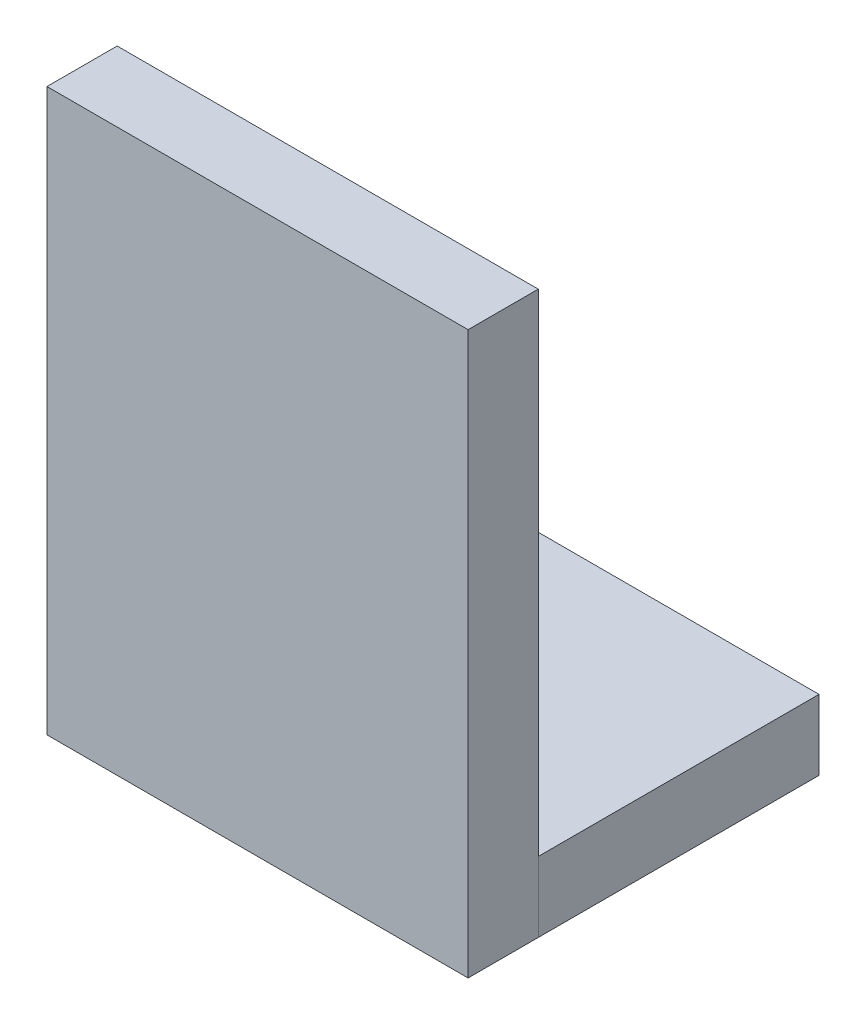
ISO-10303-21;
HEADER;
FILE_DESCRIPTION(('STEP AP214'),'2;1');
FILE_NAME('part.step','',(''),(''),'','','');
FILE_SCHEMA(('AUTOMOTIVE_DESIGN { 1 0 10303 214 1 1 1 1 }'));
ENDSEC;
DATA;
#1=APPLICATION_CONTEXT('core data for automotive mechanical design processes');
#2=APPLICATION_PROTOCOL_DEFINITION('international standard','automotive_design',2000,#1);
#3=PRODUCT_CONTEXT('',#1,'mechanical');
#4=PRODUCT('Part','Part','',(#3));
#5=PRODUCT_RELATED_PRODUCT_CATEGORY('part','',(#4));
#6=PRODUCT_DEFINITION_FORMATION('','',#4);
#7=PRODUCT_DEFINITION_CONTEXT('part definition',#1,'design');
#8=PRODUCT_DEFINITION('design','',#6,#7);
#9=PRODUCT_DEFINITION_SHAPE('','',#8);
#10=(LENGTH_UNIT() NAMED_UNIT(*) SI_UNIT(.MILLI.,.METRE.));
#11=(NAMED_UNIT(*) PLANE_ANGLE_UNIT() SI_UNIT($,.RADIAN.));
#12=(NAMED_UNIT(*) SI_UNIT($,.STERADIAN.) SOLID_ANGLE_UNIT());
#13=UNCERTAINTY_MEASURE_WITH_UNIT(LENGTH_MEASURE(1.E-05),#10,'distance_accuracy_value','');
#14=(GEOMETRIC_REPRESENTATION_CONTEXT(3) GLOBAL_UNCERTAINTY_ASSIGNED_CONTEXT((#13)) GLOBAL_UNIT_ASSIGNED_CONTEXT((#10,
#11,#12)) REPRESENTATION_CONTEXT('',''));
#15=CARTESIAN_POINT('',(0.,0.,0.));
#16=DIRECTION('',(0.,0.,1.));
#17=DIRECTION('',(1.,0.,0.));
#18=AXIS2_PLACEMENT_3D('',#15,#16,#17);
#19=CARTESIAN_POINT('',(0.,0.,6.35));
#20=DIRECTION('',(1.,0.,0.));
#21=DIRECTION('',(0.,1.,0.));
#22=AXIS2_PLACEMENT_3D('',#19,#20,#21);
#23=PLANE('',#22);
#24=DIRECTION('',(0.,-1.,0.));
#25=VECTOR('',#24,1.);
#26=CARTESIAN_POINT('',(0.,0.,5.08));
#27=LINE('',#26,#25);
#28=CARTESIAN_POINT('',(0.,10.16,5.08));
#29=VERTEX_POINT('',#28);
#30=CARTESIAN_POINT('',(0.,0.,5.08));
#31=VERTEX_POINT('',#30);
#32=EDGE_CURVE('E117',#29,#31,#27,.T.);
#33=ORIENTED_EDGE('',*,*,#32,.T.);
#34=DIRECTION('',(0.,0.,-1.));
#35=VECTOR('',#34,1.);
#36=CARTESIAN_POINT('',(0.,0.,6.35));
#37=LINE('',#36,#35);
#38=CARTESIAN_POINT('',(0.,0.,6.35));
#39=VERTEX_POINT('',#38);
#40=EDGE_CURVE('E12',#39,#31,#37,.T.);
#41=ORIENTED_EDGE('',*,*,#40,.F.);
#42=DIRECTION('',(0.,-1.,0.));
#43=VECTOR('',#42,1.);
#44=CARTESIAN_POINT('',(0.,0.,6.35));
#45=LINE('',#44,#43);
#46=CARTESIAN_POINT('',(0.,10.16,6.35));
#47=VERTEX_POINT('',#46);
#48=EDGE_CURVE('E101',#47,#39,#45,.T.);
#49=ORIENTED_EDGE('',*,*,#48,.F.);
#50=DIRECTION('',(0.,0.,-1.));
#51=VECTOR('',#50,1.);
#52=CARTESIAN_POINT('',(0.,10.16,6.35));
#53=LINE('',#52,#51);
#54=EDGE_CURVE('E113',#47,#29,#53,.T.);
#55=ORIENTED_EDGE('',*,*,#54,.T.);
#56=EDGE_LOOP('',(#33,#41,#49,#55));
#57=FACE_BOUND('',#56,.T.);
#58=ADVANCED_FACE('F49',(#57),#23,.F.);
#59=CARTESIAN_POINT('',(0.,0.,6.35));
#60=DIRECTION('',(0.,1.,0.));
#61=DIRECTION('',(0.,0.,1.));
#62=AXIS2_PLACEMENT_3D('',#59,#60,#61);
#63=PLANE('',#62);
#64=DIRECTION('',(1.,0.,0.));
#65=VECTOR('',#64,1.);
#66=CARTESIAN_POINT('',(0.,0.,5.08));
#67=LINE('',#66,#65);
#68=CARTESIAN_POINT('',(7.62,0.,5.08));
#69=VERTEX_POINT('',#68);
#70=EDGE_CURVE('E106',#31,#69,#67,.T.);
#71=ORIENTED_EDGE('',*,*,#70,.T.);
#72=DIRECTION('',(0.,0.,-1.));
#73=VECTOR('',#72,1.);
#74=CARTESIAN_POINT('',(7.62,0.,6.35));
#75=LINE('',#74,#73);
#76=CARTESIAN_POINT('',(7.62,0.,6.35));
#77=VERTEX_POINT('',#76);
#78=EDGE_CURVE('E58',#77,#69,#75,.T.);
#79=ORIENTED_EDGE('',*,*,#78,.F.);
#80=DIRECTION('',(1.,0.,0.));
#81=VECTOR('',#80,1.);
#82=CARTESIAN_POINT('',(0.,0.,6.35));
#83=LINE('',#82,#81);
#84=EDGE_CURVE('E96',#39,#77,#83,.T.);
#85=ORIENTED_EDGE('',*,*,#84,.F.);
#86=ORIENTED_EDGE('',*,*,#40,.T.);
#87=EDGE_LOOP('',(#71,#79,#85,#86));
#88=FACE_BOUND('',#87,.T.);
#89=ADVANCED_FACE('F105',(#88),#63,.F.);
#90=CARTESIAN_POINT('',(7.62,0.,6.35));
#91=DIRECTION('',(-1.,0.,0.));
#92=DIRECTION('',(0.,0.,1.));
#93=AXIS2_PLACEMENT_3D('',#90,#91,#92);
#94=PLANE('',#93);
#95=DIRECTION('',(0.,1.,0.));
#96=VECTOR('',#95,1.);
#97=CARTESIAN_POINT('',(7.62,0.,5.08));
#98=LINE('',#97,#96);
#99=CARTESIAN_POINT('',(7.62,10.16,5.08));
#100=VERTEX_POINT('',#99);
#101=EDGE_CURVE('E83',#69,#100,#98,.T.);
#102=ORIENTED_EDGE('',*,*,#101,.T.);
#103=DIRECTION('',(0.,0.,-1.));
#104=VECTOR('',#103,1.);
#105=CARTESIAN_POINT('',(7.62,10.16,6.35));
#106=LINE('',#105,#104);
#107=CARTESIAN_POINT('',(7.62,10.16,6.35));
#108=VERTEX_POINT('',#107);
#109=EDGE_CURVE('E108',#108,#100,#106,.T.);
#110=ORIENTED_EDGE('',*,*,#109,.F.);
#111=DIRECTION('',(0.,1.,0.));
#112=VECTOR('',#111,1.);
#113=CARTESIAN_POINT('',(7.62,0.,6.35));
#114=LINE('',#113,#112);
#115=EDGE_CURVE('E99',#77,#108,#114,.T.);
#116=ORIENTED_EDGE('',*,*,#115,.F.);
#117=ORIENTED_EDGE('',*,*,#78,.T.);
#118=EDGE_LOOP('',(#102,#110,#116,#117));
#119=FACE_BOUND('',#118,.T.);
#120=ADVANCED_FACE('F109',(#119),#94,.F.);
#121=CARTESIAN_POINT('',(0.,10.16,6.35));
#122=DIRECTION('',(0.,-1.,0.));
#123=DIRECTION('',(0.,0.,-1.));
#124=AXIS2_PLACEMENT_3D('',#121,#122,#123);
#125=PLANE('',#124);
#126=DIRECTION('',(-1.,0.,0.));
#127=VECTOR('',#126,1.);
#128=CARTESIAN_POINT('',(0.,10.16,5.08));
#129=LINE('',#128,#127);
#130=EDGE_CURVE('E89',#100,#29,#129,.T.);
#131=ORIENTED_EDGE('',*,*,#130,.T.);
#132=ORIENTED_EDGE('',*,*,#54,.F.);
#133=DIRECTION('',(-1.,0.,0.));
#134=VECTOR('',#133,1.);
#135=CARTESIAN_POINT('',(0.,10.16,6.35));
#136=LINE('',#135,#134);
#137=EDGE_CURVE('E66',#108,#47,#136,.T.);
#138=ORIENTED_EDGE('',*,*,#137,.F.);
#139=ORIENTED_EDGE('',*,*,#109,.T.);
#140=EDGE_LOOP('',(#131,#132,#138,#139));
#141=FACE_BOUND('',#140,.T.);
#142=ADVANCED_FACE('F130',(#141),#125,.F.);
#143=CARTESIAN_POINT('',(0.,0.,6.35));
#144=DIRECTION('',(0.,0.,-1.));
#145=DIRECTION('',(-1.,0.,0.));
#146=AXIS2_PLACEMENT_3D('',#143,#144,#145);
#147=PLANE('',#146);
#148=ORIENTED_EDGE('',*,*,#48,.T.);
#149=ORIENTED_EDGE('',*,*,#84,.T.);
#150=ORIENTED_EDGE('',*,*,#115,.T.);
#151=ORIENTED_EDGE('',*,*,#137,.T.);
#152=EDGE_LOOP('',(#148,#149,#150,#151));
#153=FACE_BOUND('',#152,.T.);
#154=ADVANCED_FACE('F97',(#153),#147,.F.);
#155=CARTESIAN_POINT('',(0.,0.,5.08));
#156=DIRECTION('',(0.,0.,-1.));
#157=DIRECTION('',(-1.,0.,0.));
#158=AXIS2_PLACEMENT_3D('',#155,#156,#157);
#159=PLANE('',#158);
#160=ORIENTED_EDGE('',*,*,#32,.F.);
#161=ORIENTED_EDGE('',*,*,#130,.F.);
#162=ORIENTED_EDGE('',*,*,#101,.F.);
#163=ORIENTED_EDGE('',*,*,#70,.F.);
#164=EDGE_LOOP('',(#160,#161,#162,#163));
#165=FACE_BOUND('',#164,.T.);
#166=ADVANCED_FACE('F133',(#165),#159,.T.);
#167=CLOSED_SHELL('',(#58,#89,#120,#142,#154,#166));
#168=MANIFOLD_SOLID_BREP('B2',#167);
#169=CARTESIAN_POINT('',(0.,1.27,0.));
#170=DIRECTION('',(1.,0.,0.));
#171=DIRECTION('',(0.,0.,-1.));
#172=AXIS2_PLACEMENT_3D('',#169,#170,#171);
#173=PLANE('',#172);
#174=DIRECTION('',(0.,0.,1.));
#175=VECTOR('',#174,1.);
#176=CARTESIAN_POINT('',(0.,0.,0.));
#177=LINE('',#176,#175);
#178=CARTESIAN_POINT('',(0.,0.,0.));
#179=VERTEX_POINT('',#178);
#180=CARTESIAN_POINT('',(0.,0.,5.08));
#181=VERTEX_POINT('',#180);
#182=EDGE_CURVE('E248',#179,#181,#177,.T.);
#183=ORIENTED_EDGE('',*,*,#182,.T.);
#184=DIRECTION('',(0.,-1.,0.));
#185=VECTOR('',#184,1.);
#186=CARTESIAN_POINT('',(0.,1.27,5.08));
#187=LINE('',#186,#185);
#188=CARTESIAN_POINT('',(0.,1.27,5.08));
#189=VERTEX_POINT('',#188);
#190=EDGE_CURVE('E47',#189,#181,#187,.T.);
#191=ORIENTED_EDGE('',*,*,#190,.F.);
#192=DIRECTION('',(0.,0.,1.));
#193=VECTOR('',#192,1.);
#194=CARTESIAN_POINT('',(0.,1.27,0.));
#195=LINE('',#194,#193);
#196=CARTESIAN_POINT('',(0.,1.27,0.));
#197=VERTEX_POINT('',#196);
#198=EDGE_CURVE('E236',#197,#189,#195,.T.);
#199=ORIENTED_EDGE('',*,*,#198,.F.);
#200=DIRECTION('',(0.,-1.,0.));
#201=VECTOR('',#200,1.);
#202=CARTESIAN_POINT('',(0.,1.27,0.));
#203=LINE('',#202,#201);
#204=EDGE_CURVE('E244',#197,#179,#203,.T.);
#205=ORIENTED_EDGE('',*,*,#204,.T.);
#206=EDGE_LOOP('',(#183,#191,#199,#205));
#207=FACE_BOUND('',#206,.T.);
#208=ADVANCED_FACE('F185',(#207),#173,.F.);
#209=CARTESIAN_POINT('',(0.,1.27,5.08));
#210=DIRECTION('',(0.,0.,-1.));
#211=DIRECTION('',(-1.,0.,0.));
#212=AXIS2_PLACEMENT_3D('',#209,#210,#211);
#213=PLANE('',#212);
#214=DIRECTION('',(1.,0.,0.));
#215=VECTOR('',#214,1.);
#216=CARTESIAN_POINT('',(0.,0.,5.08));
#217=LINE('',#216,#215);
#218=CARTESIAN_POINT('',(7.62,0.,5.08));
#219=VERTEX_POINT('',#218);
#220=EDGE_CURVE('E240',#181,#219,#217,.T.);
#221=ORIENTED_EDGE('',*,*,#220,.T.);
#222=DIRECTION('',(0.,-1.,0.));
#223=VECTOR('',#222,1.);
#224=CARTESIAN_POINT('',(7.62,1.27,5.08));
#225=LINE('',#224,#223);
#226=CARTESIAN_POINT('',(7.62,1.27,5.08));
#227=VERTEX_POINT('',#226);
#228=EDGE_CURVE('E193',#227,#219,#225,.T.);
#229=ORIENTED_EDGE('',*,*,#228,.F.);
#230=DIRECTION('',(1.,0.,0.));
#231=VECTOR('',#230,1.);
#232=CARTESIAN_POINT('',(0.,1.27,5.08));
#233=LINE('',#232,#231);
#234=EDGE_CURVE('E231',#189,#227,#233,.T.);
#235=ORIENTED_EDGE('',*,*,#234,.F.);
#236=ORIENTED_EDGE('',*,*,#190,.T.);
#237=EDGE_LOOP('',(#221,#229,#235,#236));
#238=FACE_BOUND('',#237,.T.);
#239=ADVANCED_FACE('F239',(#238),#213,.F.);
#240=CARTESIAN_POINT('',(7.62,1.27,0.));
#241=DIRECTION('',(-1.,0.,0.));
#242=DIRECTION('',(0.,0.,1.));
#243=AXIS2_PLACEMENT_3D('',#240,#241,#242);
#244=PLANE('',#243);
#245=DIRECTION('',(0.,0.,-1.));
#246=VECTOR('',#245,1.);
#247=CARTESIAN_POINT('',(7.62,0.,0.));
#248=LINE('',#247,#246);
#249=CARTESIAN_POINT('',(7.62,0.,0.));
#250=VERTEX_POINT('',#249);
#251=EDGE_CURVE('E218',#219,#250,#248,.T.);
#252=ORIENTED_EDGE('',*,*,#251,.T.);
#253=DIRECTION('',(0.,-1.,0.));
#254=VECTOR('',#253,1.);
#255=CARTESIAN_POINT('',(7.62,1.27,0.));
#256=LINE('',#255,#254);
#257=CARTESIAN_POINT('',(7.62,1.27,0.));
#258=VERTEX_POINT('',#257);
#259=EDGE_CURVE('E241',#258,#250,#256,.T.);
#260=ORIENTED_EDGE('',*,*,#259,.F.);
#261=DIRECTION('',(0.,0.,-1.));
#262=VECTOR('',#261,1.);
#263=CARTESIAN_POINT('',(7.62,1.27,0.));
#264=LINE('',#263,#262);
#265=EDGE_CURVE('E234',#227,#258,#264,.T.);
#266=ORIENTED_EDGE('',*,*,#265,.F.);
#267=ORIENTED_EDGE('',*,*,#228,.T.);
#268=EDGE_LOOP('',(#252,#260,#266,#267));
#269=FACE_BOUND('',#268,.T.);
#270=ADVANCED_FACE('F242',(#269),#244,.F.);
#271=CARTESIAN_POINT('',(0.,1.27,0.));
#272=DIRECTION('',(0.,0.,1.));
#273=DIRECTION('',(1.,0.,0.));
#274=AXIS2_PLACEMENT_3D('',#271,#272,#273);
#275=PLANE('',#274);
#276=DIRECTION('',(-1.,0.,0.));
#277=VECTOR('',#276,1.);
#278=CARTESIAN_POINT('',(0.,0.,0.));
#279=LINE('',#278,#277);
#280=EDGE_CURVE('E224',#250,#179,#279,.T.);
#281=ORIENTED_EDGE('',*,*,#280,.T.);
#282=ORIENTED_EDGE('',*,*,#204,.F.);
#283=DIRECTION('',(-1.,0.,0.));
#284=VECTOR('',#283,1.);
#285=CARTESIAN_POINT('',(0.,1.27,0.));
#286=LINE('',#285,#284);
#287=EDGE_CURVE('E201',#258,#197,#286,.T.);
#288=ORIENTED_EDGE('',*,*,#287,.F.);
#289=ORIENTED_EDGE('',*,*,#259,.T.);
#290=EDGE_LOOP('',(#281,#282,#288,#289));
#291=FACE_BOUND('',#290,.T.);
#292=ADVANCED_FACE('F255',(#291),#275,.F.);
#293=CARTESIAN_POINT('',(0.,1.27,0.));
#294=DIRECTION('',(0.,1.,0.));
#295=DIRECTION('',(0.,0.,1.));
#296=AXIS2_PLACEMENT_3D('',#293,#294,#295);
#297=PLANE('',#296);
#298=ORIENTED_EDGE('',*,*,#198,.T.);
#299=ORIENTED_EDGE('',*,*,#234,.T.);
#300=ORIENTED_EDGE('',*,*,#265,.T.);
#301=ORIENTED_EDGE('',*,*,#287,.T.);
#302=EDGE_LOOP('',(#298,#299,#300,#301));
#303=FACE_BOUND('',#302,.T.);
#304=ADVANCED_FACE('F232',(#303),#297,.T.);
#305=CARTESIAN_POINT('',(0.,0.,0.));
#306=DIRECTION('',(0.,1.,0.));
#307=DIRECTION('',(0.,0.,1.));
#308=AXIS2_PLACEMENT_3D('',#305,#306,#307);
#309=PLANE('',#308);
#310=ORIENTED_EDGE('',*,*,#182,.F.);
#311=ORIENTED_EDGE('',*,*,#280,.F.);
#312=ORIENTED_EDGE('',*,*,#251,.F.);
#313=ORIENTED_EDGE('',*,*,#220,.F.);
#314=EDGE_LOOP('',(#310,#311,#312,#313));
#315=FACE_BOUND('',#314,.T.);
#316=ADVANCED_FACE('F258',(#315),#309,.F.);
#317=CLOSED_SHELL('',(#208,#239,#270,#292,#304,#316));
#318=MANIFOLD_SOLID_BREP('B6',#317);
#319=ADVANCED_BREP_SHAPE_REPRESENTATION('',(#18,#168,#318),#14);
#320=SHAPE_DEFINITION_REPRESENTATION(#9,#319);
ENDSEC;
END-ISO-10303-21;
